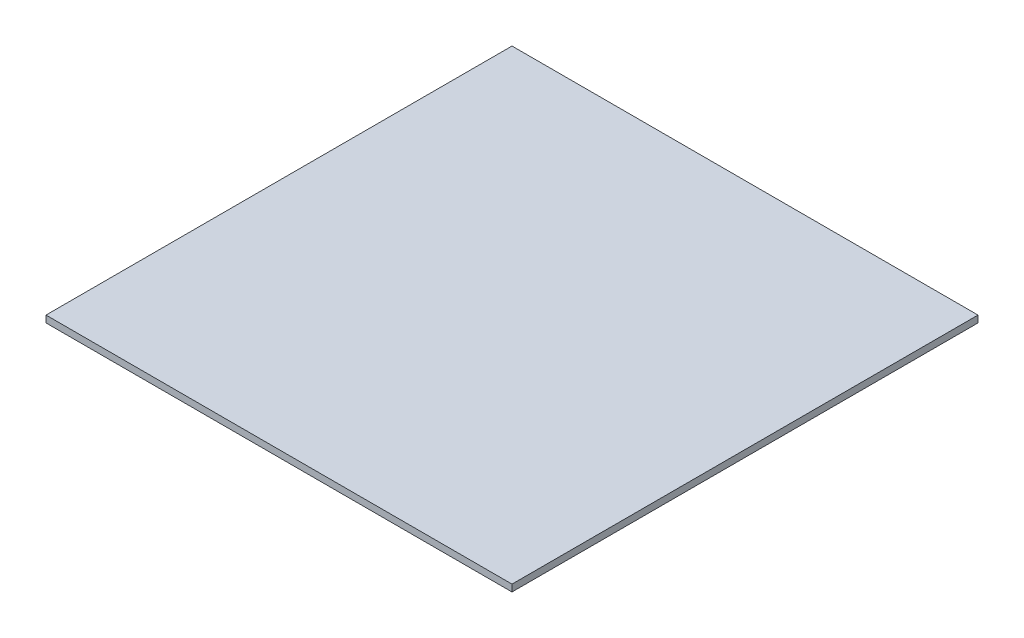
ISO-10303-21;
HEADER;
FILE_DESCRIPTION(('STEP AP214'),'2;1');
FILE_NAME('part.step','',(''),(''),'','','');
FILE_SCHEMA(('AUTOMOTIVE_DESIGN { 1 0 10303 214 1 1 1 1 }'));
ENDSEC;
DATA;
#1=APPLICATION_CONTEXT('core data for automotive mechanical design processes');
#2=APPLICATION_PROTOCOL_DEFINITION('international standard','automotive_design',2000,#1);
#3=PRODUCT_CONTEXT('',#1,'mechanical');
#4=PRODUCT('Part','Part','',(#3));
#5=PRODUCT_RELATED_PRODUCT_CATEGORY('part','',(#4));
#6=PRODUCT_DEFINITION_FORMATION('','',#4);
#7=PRODUCT_DEFINITION_CONTEXT('part definition',#1,'design');
#8=PRODUCT_DEFINITION('design','',#6,#7);
#9=PRODUCT_DEFINITION_SHAPE('','',#8);
#10=(LENGTH_UNIT() NAMED_UNIT(*) SI_UNIT(.MILLI.,.METRE.));
#11=(NAMED_UNIT(*) PLANE_ANGLE_UNIT() SI_UNIT($,.RADIAN.));
#12=(NAMED_UNIT(*) SI_UNIT($,.STERADIAN.) SOLID_ANGLE_UNIT());
#13=UNCERTAINTY_MEASURE_WITH_UNIT(LENGTH_MEASURE(1.E-05),#10,'distance_accuracy_value','');
#14=(GEOMETRIC_REPRESENTATION_CONTEXT(3) GLOBAL_UNCERTAINTY_ASSIGNED_CONTEXT((#13)) GLOBAL_UNIT_ASSIGNED_CONTEXT((#10,
#11,#12)) REPRESENTATION_CONTEXT('',''));
#15=CARTESIAN_POINT('',(0.,0.,0.));
#16=DIRECTION('',(0.,0.,1.));
#17=DIRECTION('',(1.,0.,0.));
#18=AXIS2_PLACEMENT_3D('',#15,#16,#17);
#19=CARTESIAN_POINT('',(37.5,1.1,-37.5));
#20=DIRECTION('',(-1.,0.,0.));
#21=DIRECTION('',(0.,0.,1.));
#22=AXIS2_PLACEMENT_3D('',#19,#20,#21);
#23=PLANE('',#22);
#24=DIRECTION('',(0.,0.,-1.));
#25=VECTOR('',#24,1.);
#26=CARTESIAN_POINT('',(37.5,0.,-37.5));
#27=LINE('',#26,#25);
#28=CARTESIAN_POINT('',(37.5,0.,37.5));
#29=VERTEX_POINT('',#28);
#30=CARTESIAN_POINT('',(37.5,0.,-37.5));
#31=VERTEX_POINT('',#30);
#32=EDGE_CURVE('E96',#29,#31,#27,.T.);
#33=ORIENTED_EDGE('',*,*,#32,.T.);
#34=DIRECTION('',(0.,-1.,0.));
#35=VECTOR('',#34,1.);
#36=CARTESIAN_POINT('',(37.5,1.1,-37.5));
#37=LINE('',#36,#35);
#38=CARTESIAN_POINT('',(37.5,1.1,-37.5));
#39=VERTEX_POINT('',#38);
#40=EDGE_CURVE('E11',#39,#31,#37,.T.);
#41=ORIENTED_EDGE('',*,*,#40,.F.);
#42=DIRECTION('',(0.,0.,-1.));
#43=VECTOR('',#42,1.);
#44=CARTESIAN_POINT('',(37.5,1.1,-37.5));
#45=LINE('',#44,#43);
#46=CARTESIAN_POINT('',(37.5,1.1,37.5));
#47=VERTEX_POINT('',#46);
#48=EDGE_CURVE('E84',#47,#39,#45,.T.);
#49=ORIENTED_EDGE('',*,*,#48,.F.);
#50=DIRECTION('',(0.,-1.,0.));
#51=VECTOR('',#50,1.);
#52=CARTESIAN_POINT('',(37.5,1.1,37.5));
#53=LINE('',#52,#51);
#54=EDGE_CURVE('E92',#47,#29,#53,.T.);
#55=ORIENTED_EDGE('',*,*,#54,.T.);
#56=EDGE_LOOP('',(#33,#41,#49,#55));
#57=FACE_BOUND('',#56,.T.);
#58=ADVANCED_FACE('F33',(#57),#23,.F.);
#59=CARTESIAN_POINT('',(-37.5,1.1,-37.5));
#60=DIRECTION('',(0.,0.,1.));
#61=DIRECTION('',(1.,0.,0.));
#62=AXIS2_PLACEMENT_3D('',#59,#60,#61);
#63=PLANE('',#62);
#64=DIRECTION('',(-1.,0.,0.));
#65=VECTOR('',#64,1.);
#66=CARTESIAN_POINT('',(-37.5,0.,-37.5));
#67=LINE('',#66,#65);
#68=CARTESIAN_POINT('',(-37.5,0.,-37.5));
#69=VERTEX_POINT('',#68);
#70=EDGE_CURVE('E88',#31,#69,#67,.T.);
#71=ORIENTED_EDGE('',*,*,#70,.T.);
#72=DIRECTION('',(0.,-1.,0.));
#73=VECTOR('',#72,1.);
#74=CARTESIAN_POINT('',(-37.5,1.1,-37.5));
#75=LINE('',#74,#73);
#76=CARTESIAN_POINT('',(-37.5,1.1,-37.5));
#77=VERTEX_POINT('',#76);
#78=EDGE_CURVE('E41',#77,#69,#75,.T.);
#79=ORIENTED_EDGE('',*,*,#78,.F.);
#80=DIRECTION('',(-1.,0.,0.));
#81=VECTOR('',#80,1.);
#82=CARTESIAN_POINT('',(-37.5,1.1,-37.5));
#83=LINE('',#82,#81);
#84=EDGE_CURVE('E79',#39,#77,#83,.T.);
#85=ORIENTED_EDGE('',*,*,#84,.F.);
#86=ORIENTED_EDGE('',*,*,#40,.T.);
#87=EDGE_LOOP('',(#71,#79,#85,#86));
#88=FACE_BOUND('',#87,.T.);
#89=ADVANCED_FACE('F87',(#88),#63,.F.);
#90=CARTESIAN_POINT('',(-37.5,1.1,-37.5));
#91=DIRECTION('',(1.,0.,0.));
#92=DIRECTION('',(0.,0.,-1.));
#93=AXIS2_PLACEMENT_3D('',#90,#91,#92);
#94=PLANE('',#93);
#95=DIRECTION('',(0.,0.,1.));
#96=VECTOR('',#95,1.);
#97=CARTESIAN_POINT('',(-37.5,0.,-37.5));
#98=LINE('',#97,#96);
#99=CARTESIAN_POINT('',(-37.5,0.,37.5));
#100=VERTEX_POINT('',#99);
#101=EDGE_CURVE('E66',#69,#100,#98,.T.);
#102=ORIENTED_EDGE('',*,*,#101,.T.);
#103=DIRECTION('',(0.,-1.,0.));
#104=VECTOR('',#103,1.);
#105=CARTESIAN_POINT('',(-37.5,1.1,37.5));
#106=LINE('',#105,#104);
#107=CARTESIAN_POINT('',(-37.5,1.1,37.5));
#108=VERTEX_POINT('',#107);
#109=EDGE_CURVE('E89',#108,#100,#106,.T.);
#110=ORIENTED_EDGE('',*,*,#109,.F.);
#111=DIRECTION('',(0.,0.,1.));
#112=VECTOR('',#111,1.);
#113=CARTESIAN_POINT('',(-37.5,1.1,-37.5));
#114=LINE('',#113,#112);
#115=EDGE_CURVE('E82',#77,#108,#114,.T.);
#116=ORIENTED_EDGE('',*,*,#115,.F.);
#117=ORIENTED_EDGE('',*,*,#78,.T.);
#118=EDGE_LOOP('',(#102,#110,#116,#117));
#119=FACE_BOUND('',#118,.T.);
#120=ADVANCED_FACE('F90',(#119),#94,.F.);
#121=CARTESIAN_POINT('',(-37.5,1.1,37.5));
#122=DIRECTION('',(0.,0.,-1.));
#123=DIRECTION('',(-1.,0.,0.));
#124=AXIS2_PLACEMENT_3D('',#121,#122,#123);
#125=PLANE('',#124);
#126=DIRECTION('',(1.,0.,0.));
#127=VECTOR('',#126,1.);
#128=CARTESIAN_POINT('',(-37.5,0.,37.5));
#129=LINE('',#128,#127);
#130=EDGE_CURVE('E72',#100,#29,#129,.T.);
#131=ORIENTED_EDGE('',*,*,#130,.T.);
#132=ORIENTED_EDGE('',*,*,#54,.F.);
#133=DIRECTION('',(1.,0.,0.));
#134=VECTOR('',#133,1.);
#135=CARTESIAN_POINT('',(-37.5,1.1,37.5));
#136=LINE('',#135,#134);
#137=EDGE_CURVE('E49',#108,#47,#136,.T.);
#138=ORIENTED_EDGE('',*,*,#137,.F.);
#139=ORIENTED_EDGE('',*,*,#109,.T.);
#140=EDGE_LOOP('',(#131,#132,#138,#139));
#141=FACE_BOUND('',#140,.T.);
#142=ADVANCED_FACE('F103',(#141),#125,.F.);
#143=CARTESIAN_POINT('',(0.,1.1,0.));
#144=DIRECTION('',(0.,1.,0.));
#145=DIRECTION('',(0.,0.,1.));
#146=AXIS2_PLACEMENT_3D('',#143,#144,#145);
#147=PLANE('',#146);
#148=ORIENTED_EDGE('',*,*,#48,.T.);
#149=ORIENTED_EDGE('',*,*,#84,.T.);
#150=ORIENTED_EDGE('',*,*,#115,.T.);
#151=ORIENTED_EDGE('',*,*,#137,.T.);
#152=EDGE_LOOP('',(#148,#149,#150,#151));
#153=FACE_BOUND('',#152,.T.);
#154=ADVANCED_FACE('F80',(#153),#147,.T.);
#155=CARTESIAN_POINT('',(0.,0.,0.));
#156=DIRECTION('',(0.,1.,0.));
#157=DIRECTION('',(0.,0.,1.));
#158=AXIS2_PLACEMENT_3D('',#155,#156,#157);
#159=PLANE('',#158);
#160=ORIENTED_EDGE('',*,*,#32,.F.);
#161=ORIENTED_EDGE('',*,*,#130,.F.);
#162=ORIENTED_EDGE('',*,*,#101,.F.);
#163=ORIENTED_EDGE('',*,*,#70,.F.);
#164=EDGE_LOOP('',(#160,#161,#162,#163));
#165=FACE_BOUND('',#164,.T.);
#166=ADVANCED_FACE('F106',(#165),#159,.F.);
#167=CLOSED_SHELL('',(#58,#89,#120,#142,#154,#166));
#168=MANIFOLD_SOLID_BREP('B2',#167);
#169=ADVANCED_BREP_SHAPE_REPRESENTATION('',(#18,#168),#14);
#170=SHAPE_DEFINITION_REPRESENTATION(#9,#169);
ENDSEC;
END-ISO-10303-21;
